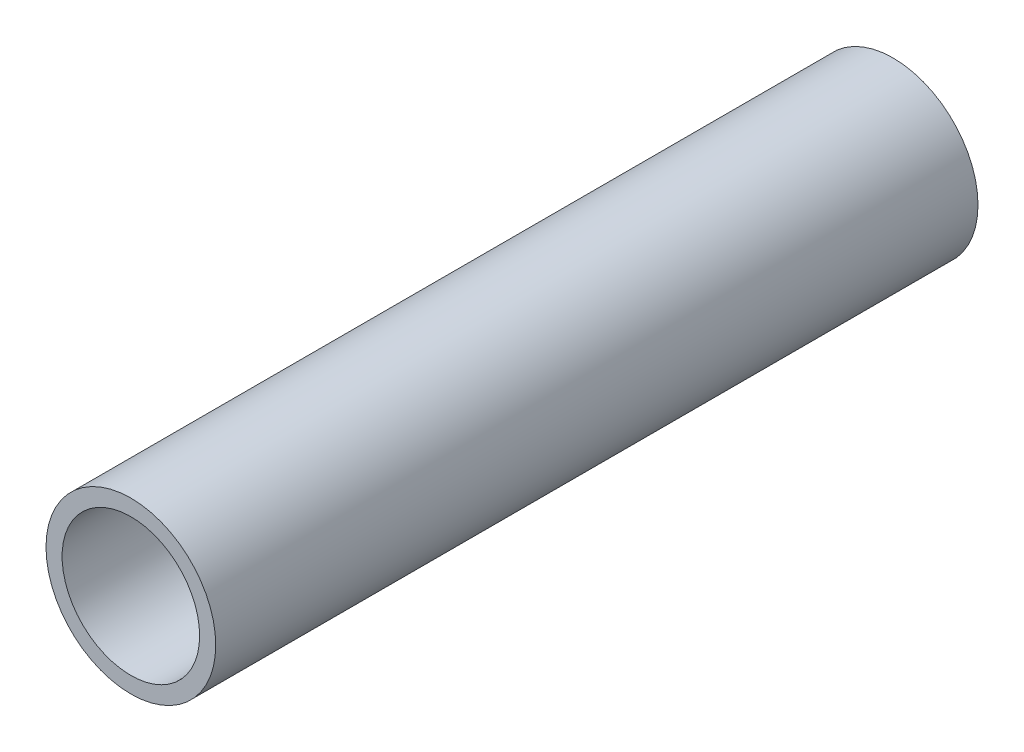
ISO-10303-21;
HEADER;
FILE_DESCRIPTION(('STEP AP214'),'2;1');
FILE_NAME('part.step','',(''),(''),'','','');
FILE_SCHEMA(('AUTOMOTIVE_DESIGN { 1 0 10303 214 1 1 1 1 }'));
ENDSEC;
DATA;
#1=APPLICATION_CONTEXT('core data for automotive mechanical design processes');
#2=APPLICATION_PROTOCOL_DEFINITION('international standard','automotive_design',2000,#1);
#3=PRODUCT_CONTEXT('',#1,'mechanical');
#4=PRODUCT('Part','Part','',(#3));
#5=PRODUCT_RELATED_PRODUCT_CATEGORY('part','',(#4));
#6=PRODUCT_DEFINITION_FORMATION('','',#4);
#7=PRODUCT_DEFINITION_CONTEXT('part definition',#1,'design');
#8=PRODUCT_DEFINITION('design','',#6,#7);
#9=PRODUCT_DEFINITION_SHAPE('','',#8);
#10=(LENGTH_UNIT() NAMED_UNIT(*) SI_UNIT(.MILLI.,.METRE.));
#11=(NAMED_UNIT(*) PLANE_ANGLE_UNIT() SI_UNIT($,.RADIAN.));
#12=(NAMED_UNIT(*) SI_UNIT($,.STERADIAN.) SOLID_ANGLE_UNIT());
#13=UNCERTAINTY_MEASURE_WITH_UNIT(LENGTH_MEASURE(1.E-05),#10,'distance_accuracy_value','');
#14=(GEOMETRIC_REPRESENTATION_CONTEXT(3) GLOBAL_UNCERTAINTY_ASSIGNED_CONTEXT((#13)) GLOBAL_UNIT_ASSIGNED_CONTEXT((#10,
#11,#12)) REPRESENTATION_CONTEXT('',''));
#15=CARTESIAN_POINT('',(0.,0.,0.));
#16=DIRECTION('',(0.,0.,1.));
#17=DIRECTION('',(1.,0.,0.));
#18=AXIS2_PLACEMENT_3D('',#15,#16,#17);
#19=CARTESIAN_POINT('',(0.,0.,150.));
#20=DIRECTION('',(0.,0.,1.));
#21=DIRECTION('',(1.,0.,0.));
#22=AXIS2_PLACEMENT_3D('',#19,#20,#21);
#23=PLANE('',#22);
#24=CARTESIAN_POINT('',(0.,0.,150.));
#25=DIRECTION('',(0.,0.,1.));
#26=DIRECTION('',(1.,0.,0.));
#27=AXIS2_PLACEMENT_3D('',#24,#25,#26);
#28=CIRCLE('',#27,16.7);
#29=CARTESIAN_POINT('',(16.7,0.,150.));
#30=VERTEX_POINT('',#29);
#31=EDGE_CURVE('E10',#30,#30,#28,.T.);
#32=ORIENTED_EDGE('',*,*,#31,.T.);
#33=EDGE_LOOP('',(#32));
#34=FACE_BOUND('',#33,.T.);
#35=CARTESIAN_POINT('',(0.,0.,150.));
#36=DIRECTION('',(0.,0.,1.));
#37=DIRECTION('',(1.,0.,0.));
#38=AXIS2_PLACEMENT_3D('',#35,#36,#37);
#39=CIRCLE('',#38,13.53);
#40=CARTESIAN_POINT('',(13.53,0.,150.));
#41=VERTEX_POINT('',#40);
#42=EDGE_CURVE('E42',#41,#41,#39,.T.);
#43=ORIENTED_EDGE('',*,*,#42,.F.);
#44=EDGE_LOOP('',(#43));
#45=FACE_BOUND('',#44,.T.);
#46=ADVANCED_FACE('F31',(#34,#45),#23,.T.);
#47=CARTESIAN_POINT('',(0.,0.,0.));
#48=DIRECTION('',(0.,0.,1.));
#49=DIRECTION('',(1.,0.,0.));
#50=AXIS2_PLACEMENT_3D('',#47,#48,#49);
#51=PLANE('',#50);
#52=CARTESIAN_POINT('',(0.,0.,0.));
#53=DIRECTION('',(0.,0.,1.));
#54=DIRECTION('',(1.,0.,0.));
#55=AXIS2_PLACEMENT_3D('',#52,#53,#54);
#56=CIRCLE('',#55,16.7);
#57=CARTESIAN_POINT('',(16.7,0.,0.));
#58=VERTEX_POINT('',#57);
#59=EDGE_CURVE('E35',#58,#58,#56,.T.);
#60=ORIENTED_EDGE('',*,*,#59,.F.);
#61=EDGE_LOOP('',(#60));
#62=FACE_BOUND('',#61,.T.);
#63=CARTESIAN_POINT('',(0.,0.,0.));
#64=DIRECTION('',(0.,0.,1.));
#65=DIRECTION('',(1.,0.,0.));
#66=AXIS2_PLACEMENT_3D('',#63,#64,#65);
#67=CIRCLE('',#66,13.53);
#68=CARTESIAN_POINT('',(13.53,0.,0.));
#69=VERTEX_POINT('',#68);
#70=EDGE_CURVE('E44',#69,#69,#67,.T.);
#71=ORIENTED_EDGE('',*,*,#70,.T.);
#72=EDGE_LOOP('',(#71));
#73=FACE_BOUND('',#72,.T.);
#74=ADVANCED_FACE('F54',(#62,#73),#51,.F.);
#75=CARTESIAN_POINT('',(0.,0.,150.));
#76=DIRECTION('',(0.,0.,-1.));
#77=DIRECTION('',(-1.,0.,0.));
#78=AXIS2_PLACEMENT_3D('',#75,#76,#77);
#79=CYLINDRICAL_SURFACE('',#78,16.7);
#80=ORIENTED_EDGE('',*,*,#31,.F.);
#81=EDGE_LOOP('',(#80));
#82=FACE_BOUND('',#81,.T.);
#83=ORIENTED_EDGE('',*,*,#59,.T.);
#84=EDGE_LOOP('',(#83));
#85=FACE_BOUND('',#84,.T.);
#86=ADVANCED_FACE('F33',(#82,#85),#79,.T.);
#87=CARTESIAN_POINT('',(0.,0.,150.));
#88=DIRECTION('',(0.,0.,-1.));
#89=DIRECTION('',(-1.,0.,0.));
#90=AXIS2_PLACEMENT_3D('',#87,#88,#89);
#91=CYLINDRICAL_SURFACE('',#90,13.53);
#92=ORIENTED_EDGE('',*,*,#42,.T.);
#93=EDGE_LOOP('',(#92));
#94=FACE_BOUND('',#93,.T.);
#95=ORIENTED_EDGE('',*,*,#70,.F.);
#96=EDGE_LOOP('',(#95));
#97=FACE_BOUND('',#96,.T.);
#98=ADVANCED_FACE('F50',(#94,#97),#91,.F.);
#99=CLOSED_SHELL('',(#46,#74,#86,#98));
#100=MANIFOLD_SOLID_BREP('B2',#99);
#101=ADVANCED_BREP_SHAPE_REPRESENTATION('',(#18,#100),#14);
#102=SHAPE_DEFINITION_REPRESENTATION(#9,#101);
ENDSEC;
END-ISO-10303-21;
